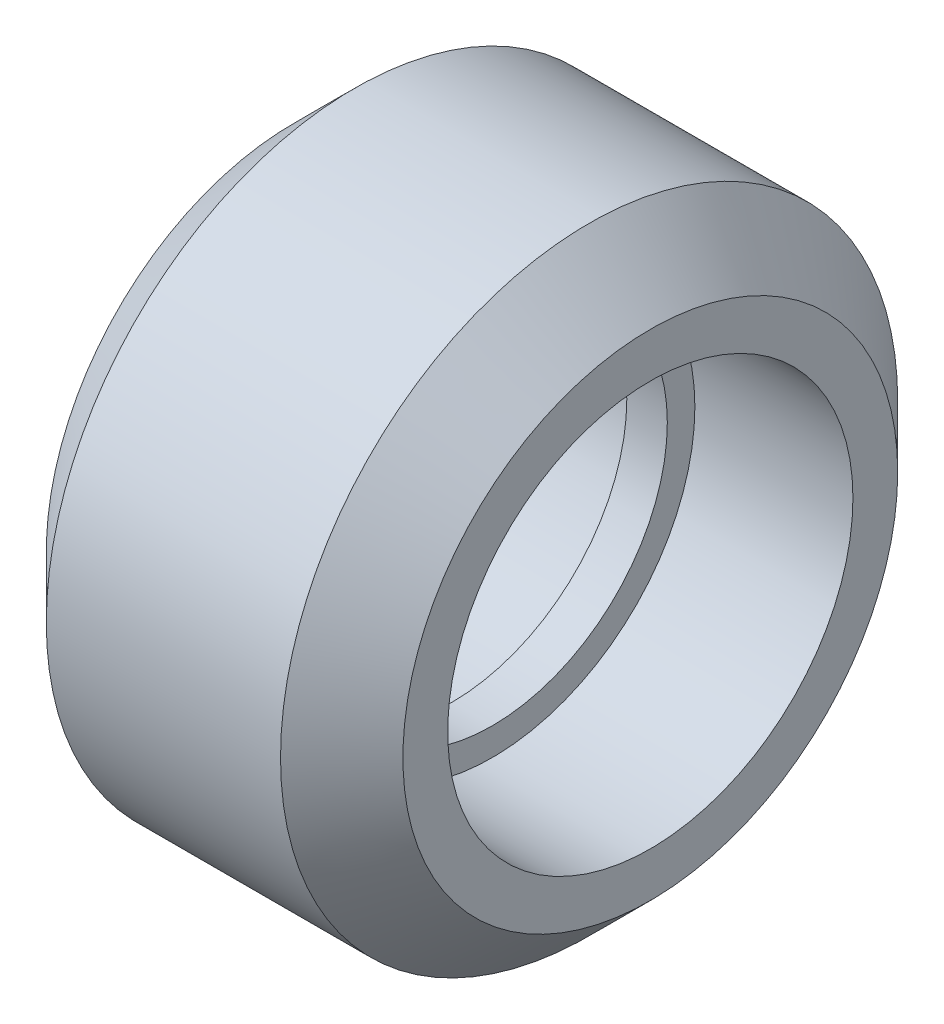
ISO-10303-21;
HEADER;
FILE_DESCRIPTION(('STEP AP214'),'2;1');
FILE_NAME('part.step','',(''),(''),'','','');
FILE_SCHEMA(('AUTOMOTIVE_DESIGN { 1 0 10303 214 1 1 1 1 }'));
ENDSEC;
DATA;
#1=APPLICATION_CONTEXT('core data for automotive mechanical design processes');
#2=APPLICATION_PROTOCOL_DEFINITION('international standard','automotive_design',2000,#1);
#3=PRODUCT_CONTEXT('',#1,'mechanical');
#4=PRODUCT('Part','Part','',(#3));
#5=PRODUCT_RELATED_PRODUCT_CATEGORY('part','',(#4));
#6=PRODUCT_DEFINITION_FORMATION('','',#4);
#7=PRODUCT_DEFINITION_CONTEXT('part definition',#1,'design');
#8=PRODUCT_DEFINITION('design','',#6,#7);
#9=PRODUCT_DEFINITION_SHAPE('','',#8);
#10=(LENGTH_UNIT() NAMED_UNIT(*) SI_UNIT(.MILLI.,.METRE.));
#11=(NAMED_UNIT(*) PLANE_ANGLE_UNIT() SI_UNIT($,.RADIAN.));
#12=(NAMED_UNIT(*) SI_UNIT($,.STERADIAN.) SOLID_ANGLE_UNIT());
#13=UNCERTAINTY_MEASURE_WITH_UNIT(LENGTH_MEASURE(1.E-05),#10,'distance_accuracy_value','');
#14=(GEOMETRIC_REPRESENTATION_CONTEXT(3) GLOBAL_UNCERTAINTY_ASSIGNED_CONTEXT((#13)) GLOBAL_UNIT_ASSIGNED_CONTEXT((#10,
#11,#12)) REPRESENTATION_CONTEXT('',''));
#15=CARTESIAN_POINT('',(0.,0.,0.));
#16=DIRECTION('',(0.,0.,1.));
#17=DIRECTION('',(1.,0.,0.));
#18=AXIS2_PLACEMENT_3D('',#15,#16,#17);
#19=CARTESIAN_POINT('',(-0.5,4.32,0.));
#20=DIRECTION('',(-1.,0.,0.));
#21=DIRECTION('',(0.,0.,1.));
#22=AXIS2_PLACEMENT_3D('',#19,#20,#21);
#23=PLANE('',#22);
#24=CARTESIAN_POINT('',(-0.5,0.,0.));
#25=DIRECTION('',(1.,0.,0.));
#26=DIRECTION('',(0.,0.,-1.));
#27=AXIS2_PLACEMENT_3D('',#24,#25,#26);
#28=CIRCLE('',#27,4.32);
#29=CARTESIAN_POINT('',(-0.5,0.,-4.32));
#30=VERTEX_POINT('',#29);
#31=EDGE_CURVE('E10',#30,#30,#28,.T.);
#32=ORIENTED_EDGE('',*,*,#31,.T.);
#33=EDGE_LOOP('',(#32));
#34=FACE_BOUND('',#33,.T.);
#35=CARTESIAN_POINT('',(-0.5,0.,0.));
#36=DIRECTION('',(1.,0.,0.));
#37=DIRECTION('',(0.,0.,-1.));
#38=AXIS2_PLACEMENT_3D('',#35,#36,#37);
#39=CIRCLE('',#38,5.);
#40=CARTESIAN_POINT('',(-0.5,0.,-5.));
#41=VERTEX_POINT('',#40);
#42=EDGE_CURVE('E67',#41,#41,#39,.T.);
#43=ORIENTED_EDGE('',*,*,#42,.F.);
#44=EDGE_LOOP('',(#43));
#45=FACE_BOUND('',#44,.T.);
#46=ADVANCED_FACE('F33',(#34,#45),#23,.T.);
#47=CARTESIAN_POINT('',(0.,0.,0.));
#48=DIRECTION('',(1.,0.,0.));
#49=DIRECTION('',(0.,0.,-1.));
#50=AXIS2_PLACEMENT_3D('',#47,#48,#49);
#51=CYLINDRICAL_SURFACE('',#50,4.32);
#52=CARTESIAN_POINT('',(0.5,0.,0.));
#53=DIRECTION('',(1.,0.,0.));
#54=DIRECTION('',(0.,0.,-1.));
#55=AXIS2_PLACEMENT_3D('',#52,#53,#54);
#56=CIRCLE('',#55,4.32);
#57=CARTESIAN_POINT('',(0.5,0.,-4.32));
#58=VERTEX_POINT('',#57);
#59=EDGE_CURVE('E39',#58,#58,#56,.T.);
#60=ORIENTED_EDGE('',*,*,#59,.T.);
#61=EDGE_LOOP('',(#60));
#62=FACE_BOUND('',#61,.T.);
#63=ORIENTED_EDGE('',*,*,#31,.F.);
#64=EDGE_LOOP('',(#63));
#65=FACE_BOUND('',#64,.T.);
#66=ADVANCED_FACE('F75',(#62,#65),#51,.F.);
#67=CARTESIAN_POINT('',(0.5,4.32,0.));
#68=DIRECTION('',(1.,0.,0.));
#69=DIRECTION('',(0.,0.,-1.));
#70=AXIS2_PLACEMENT_3D('',#67,#68,#69);
#71=PLANE('',#70);
#72=CARTESIAN_POINT('',(0.5,0.,0.));
#73=DIRECTION('',(1.,0.,0.));
#74=DIRECTION('',(0.,0.,-1.));
#75=AXIS2_PLACEMENT_3D('',#72,#73,#74);
#76=CIRCLE('',#75,5.);
#77=CARTESIAN_POINT('',(0.5,0.,-5.));
#78=VERTEX_POINT('',#77);
#79=EDGE_CURVE('E43',#78,#78,#76,.T.);
#80=ORIENTED_EDGE('',*,*,#79,.T.);
#81=EDGE_LOOP('',(#80));
#82=FACE_BOUND('',#81,.T.);
#83=ORIENTED_EDGE('',*,*,#59,.F.);
#84=EDGE_LOOP('',(#83));
#85=FACE_BOUND('',#84,.T.);
#86=ADVANCED_FACE('F79',(#82,#85),#71,.T.);
#87=CARTESIAN_POINT('',(0.,0.,0.));
#88=DIRECTION('',(1.,0.,0.));
#89=DIRECTION('',(0.,0.,-1.));
#90=AXIS2_PLACEMENT_3D('',#87,#88,#89);
#91=CYLINDRICAL_SURFACE('',#90,5.);
#92=CARTESIAN_POINT('',(4.4,0.,0.));
#93=DIRECTION('',(1.,0.,0.));
#94=DIRECTION('',(0.,0.,-1.));
#95=AXIS2_PLACEMENT_3D('',#92,#93,#94);
#96=CIRCLE('',#95,5.);
#97=CARTESIAN_POINT('',(4.4,0.,-5.));
#98=VERTEX_POINT('',#97);
#99=EDGE_CURVE('E47',#98,#98,#96,.T.);
#100=ORIENTED_EDGE('',*,*,#99,.T.);
#101=EDGE_LOOP('',(#100));
#102=FACE_BOUND('',#101,.T.);
#103=ORIENTED_EDGE('',*,*,#79,.F.);
#104=EDGE_LOOP('',(#103));
#105=FACE_BOUND('',#104,.T.);
#106=ADVANCED_FACE('F83',(#102,#105),#91,.F.);
#107=CARTESIAN_POINT('',(4.4,5.,0.));
#108=DIRECTION('',(1.,0.,0.));
#109=DIRECTION('',(0.,0.,-1.));
#110=AXIS2_PLACEMENT_3D('',#107,#108,#109);
#111=PLANE('',#110);
#112=CARTESIAN_POINT('',(4.4,0.,0.));
#113=DIRECTION('',(1.,0.,0.));
#114=DIRECTION('',(0.,0.,-1.));
#115=AXIS2_PLACEMENT_3D('',#112,#113,#114);
#116=CIRCLE('',#115,6.10500000000001);
#117=CARTESIAN_POINT('',(4.4,0.,-6.10500000000001));
#118=VERTEX_POINT('',#117);
#119=EDGE_CURVE('E52',#118,#118,#116,.T.);
#120=ORIENTED_EDGE('',*,*,#119,.T.);
#121=EDGE_LOOP('',(#120));
#122=FACE_BOUND('',#121,.T.);
#123=ORIENTED_EDGE('',*,*,#99,.F.);
#124=EDGE_LOOP('',(#123));
#125=FACE_BOUND('',#124,.T.);
#126=ADVANCED_FACE('F90',(#122,#125),#111,.T.);
#127=CARTESIAN_POINT('',(4.4,0.,0.));
#128=DIRECTION('',(-1.,0.,0.));
#129=DIRECTION('',(0.,0.,1.));
#130=AXIS2_PLACEMENT_3D('',#127,#128,#129);
#131=CONICAL_SURFACE('',#130,6.10500000000001,0.785398163397447);
#132=CARTESIAN_POINT('',(2.89,0.,0.));
#133=DIRECTION('',(1.,0.,0.));
#134=DIRECTION('',(0.,0.,-1.));
#135=AXIS2_PLACEMENT_3D('',#132,#133,#134);
#136=CIRCLE('',#135,7.615);
#137=CARTESIAN_POINT('',(2.89,0.,-7.615));
#138=VERTEX_POINT('',#137);
#139=EDGE_CURVE('E55',#138,#138,#136,.T.);
#140=ORIENTED_EDGE('',*,*,#139,.T.);
#141=EDGE_LOOP('',(#140));
#142=FACE_BOUND('',#141,.T.);
#143=ORIENTED_EDGE('',*,*,#119,.F.);
#144=EDGE_LOOP('',(#143));
#145=FACE_BOUND('',#144,.T.);
#146=ADVANCED_FACE('F94',(#142,#145),#131,.T.);
#147=CARTESIAN_POINT('',(0.,0.,0.));
#148=DIRECTION('',(1.,0.,0.));
#149=DIRECTION('',(0.,0.,-1.));
#150=AXIS2_PLACEMENT_3D('',#147,#148,#149);
#151=CYLINDRICAL_SURFACE('',#150,7.615);
#152=CARTESIAN_POINT('',(-2.89,0.,0.));
#153=DIRECTION('',(1.,0.,0.));
#154=DIRECTION('',(0.,0.,-1.));
#155=AXIS2_PLACEMENT_3D('',#152,#153,#154);
#156=CIRCLE('',#155,7.615);
#157=CARTESIAN_POINT('',(-2.89,0.,-7.615));
#158=VERTEX_POINT('',#157);
#159=EDGE_CURVE('E58',#158,#158,#156,.T.);
#160=ORIENTED_EDGE('',*,*,#159,.T.);
#161=EDGE_LOOP('',(#160));
#162=FACE_BOUND('',#161,.T.);
#163=ORIENTED_EDGE('',*,*,#139,.F.);
#164=EDGE_LOOP('',(#163));
#165=FACE_BOUND('',#164,.T.);
#166=ADVANCED_FACE('F98',(#162,#165),#151,.T.);
#167=CARTESIAN_POINT('',(-2.89,0.,0.));
#168=DIRECTION('',(1.,0.,0.));
#169=DIRECTION('',(0.,0.,-1.));
#170=AXIS2_PLACEMENT_3D('',#167,#168,#169);
#171=CONICAL_SURFACE('',#170,7.615,0.785398163397447);
#172=CARTESIAN_POINT('',(-4.4,0.,0.));
#173=DIRECTION('',(1.,0.,0.));
#174=DIRECTION('',(0.,0.,-1.));
#175=AXIS2_PLACEMENT_3D('',#172,#173,#174);
#176=CIRCLE('',#175,6.105);
#177=CARTESIAN_POINT('',(-4.4,0.,-6.105));
#178=VERTEX_POINT('',#177);
#179=EDGE_CURVE('E61',#178,#178,#176,.T.);
#180=ORIENTED_EDGE('',*,*,#179,.T.);
#181=EDGE_LOOP('',(#180));
#182=FACE_BOUND('',#181,.T.);
#183=ORIENTED_EDGE('',*,*,#159,.F.);
#184=EDGE_LOOP('',(#183));
#185=FACE_BOUND('',#184,.T.);
#186=ADVANCED_FACE('F102',(#182,#185),#171,.T.);
#187=CARTESIAN_POINT('',(-4.4,5.,0.));
#188=DIRECTION('',(-1.,0.,0.));
#189=DIRECTION('',(0.,0.,1.));
#190=AXIS2_PLACEMENT_3D('',#187,#188,#189);
#191=PLANE('',#190);
#192=CARTESIAN_POINT('',(-4.4,0.,0.));
#193=DIRECTION('',(1.,0.,0.));
#194=DIRECTION('',(0.,0.,-1.));
#195=AXIS2_PLACEMENT_3D('',#192,#193,#194);
#196=CIRCLE('',#195,5.);
#197=CARTESIAN_POINT('',(-4.4,0.,-5.));
#198=VERTEX_POINT('',#197);
#199=EDGE_CURVE('E64',#198,#198,#196,.T.);
#200=ORIENTED_EDGE('',*,*,#199,.T.);
#201=EDGE_LOOP('',(#200));
#202=FACE_BOUND('',#201,.T.);
#203=ORIENTED_EDGE('',*,*,#179,.F.);
#204=EDGE_LOOP('',(#203));
#205=FACE_BOUND('',#204,.T.);
#206=ADVANCED_FACE('F106',(#202,#205),#191,.T.);
#207=CARTESIAN_POINT('',(0.,0.,0.));
#208=DIRECTION('',(1.,0.,0.));
#209=DIRECTION('',(0.,0.,-1.));
#210=AXIS2_PLACEMENT_3D('',#207,#208,#209);
#211=CYLINDRICAL_SURFACE('',#210,5.);
#212=ORIENTED_EDGE('',*,*,#42,.T.);
#213=EDGE_LOOP('',(#212));
#214=FACE_BOUND('',#213,.T.);
#215=ORIENTED_EDGE('',*,*,#199,.F.);
#216=EDGE_LOOP('',(#215));
#217=FACE_BOUND('',#216,.T.);
#218=ADVANCED_FACE('F71',(#214,#217),#211,.F.);
#219=CLOSED_SHELL('',(#46,#66,#86,#106,#126,#146,#166,#186,#206,#218));
#220=MANIFOLD_SOLID_BREP('B2',#219);
#221=ADVANCED_BREP_SHAPE_REPRESENTATION('',(#18,#220),#14);
#222=SHAPE_DEFINITION_REPRESENTATION(#9,#221);
ENDSEC;
END-ISO-10303-21;
